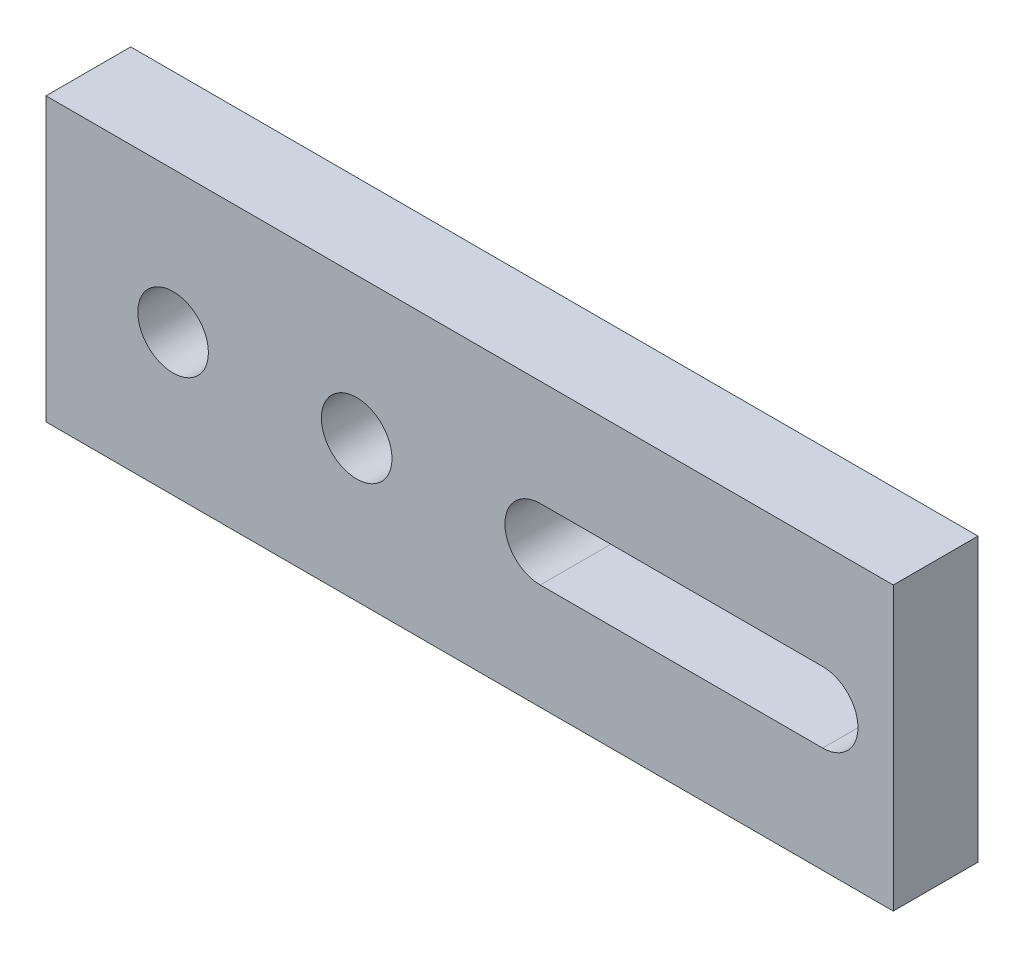
ISO-10303-21;
HEADER;
FILE_DESCRIPTION(('STEP AP214'),'2;1');
FILE_NAME('part.step','',(''),(''),'','','');
FILE_SCHEMA(('AUTOMOTIVE_DESIGN { 1 0 10303 214 1 1 1 1 }'));
ENDSEC;
DATA;
#1=APPLICATION_CONTEXT('core data for automotive mechanical design processes');
#2=APPLICATION_PROTOCOL_DEFINITION('international standard','automotive_design',2000,#1);
#3=PRODUCT_CONTEXT('',#1,'mechanical');
#4=PRODUCT('Part','Part','',(#3));
#5=PRODUCT_RELATED_PRODUCT_CATEGORY('part','',(#4));
#6=PRODUCT_DEFINITION_FORMATION('','',#4);
#7=PRODUCT_DEFINITION_CONTEXT('part definition',#1,'design');
#8=PRODUCT_DEFINITION('design','',#6,#7);
#9=PRODUCT_DEFINITION_SHAPE('','',#8);
#10=(LENGTH_UNIT() NAMED_UNIT(*) SI_UNIT(.MILLI.,.METRE.));
#11=(NAMED_UNIT(*) PLANE_ANGLE_UNIT() SI_UNIT($,.RADIAN.));
#12=(NAMED_UNIT(*) SI_UNIT($,.STERADIAN.) SOLID_ANGLE_UNIT());
#13=UNCERTAINTY_MEASURE_WITH_UNIT(LENGTH_MEASURE(1.E-05),#10,'distance_accuracy_value','');
#14=(GEOMETRIC_REPRESENTATION_CONTEXT(3) GLOBAL_UNCERTAINTY_ASSIGNED_CONTEXT((#13)) GLOBAL_UNIT_ASSIGNED_CONTEXT((#10,
#11,#12)) REPRESENTATION_CONTEXT('',''));
#15=CARTESIAN_POINT('',(0.,0.,0.));
#16=DIRECTION('',(0.,0.,1.));
#17=DIRECTION('',(1.,0.,0.));
#18=AXIS2_PLACEMENT_3D('',#15,#16,#17);
#19=CARTESIAN_POINT('',(0.,0.,6.));
#20=DIRECTION('',(0.,0.,-1.));
#21=DIRECTION('',(-1.,0.,0.));
#22=AXIS2_PLACEMENT_3D('',#19,#20,#21);
#23=PLANE('',#22);
#24=DIRECTION('',(0.,-1.,0.));
#25=VECTOR('',#24,1.);
#26=CARTESIAN_POINT('',(0.,0.,6.));
#27=LINE('',#26,#25);
#28=CARTESIAN_POINT('',(0.,20.,6.));
#29=VERTEX_POINT('',#28);
#30=CARTESIAN_POINT('',(0.,0.,6.));
#31=VERTEX_POINT('',#30);
#32=EDGE_CURVE('E156',#29,#31,#27,.T.);
#33=ORIENTED_EDGE('',*,*,#32,.T.);
#34=DIRECTION('',(1.,0.,0.));
#35=VECTOR('',#34,1.);
#36=CARTESIAN_POINT('',(0.,0.,6.));
#37=LINE('',#36,#35);
#38=CARTESIAN_POINT('',(60.,0.,6.));
#39=VERTEX_POINT('',#38);
#40=EDGE_CURVE('E160',#31,#39,#37,.T.);
#41=ORIENTED_EDGE('',*,*,#40,.T.);
#42=DIRECTION('',(0.,1.,0.));
#43=VECTOR('',#42,1.);
#44=CARTESIAN_POINT('',(60.,0.,6.));
#45=LINE('',#44,#43);
#46=CARTESIAN_POINT('',(60.,20.,6.));
#47=VERTEX_POINT('',#46);
#48=EDGE_CURVE('E164',#39,#47,#45,.T.);
#49=ORIENTED_EDGE('',*,*,#48,.T.);
#50=DIRECTION('',(-1.,0.,0.));
#51=VECTOR('',#50,1.);
#52=CARTESIAN_POINT('',(0.,20.,6.));
#53=LINE('',#52,#51);
#54=EDGE_CURVE('E167',#47,#29,#53,.T.);
#55=ORIENTED_EDGE('',*,*,#54,.T.);
#56=EDGE_LOOP('',(#33,#41,#49,#55));
#57=FACE_BOUND('',#56,.T.);
#58=CARTESIAN_POINT('',(35.,10.,6.));
#59=DIRECTION('',(0.,0.,1.));
#60=DIRECTION('',(1.,0.,0.));
#61=AXIS2_PLACEMENT_3D('',#58,#59,#60);
#62=CIRCLE('',#61,2.5);
#63=CARTESIAN_POINT('',(35.,12.5,6.));
#64=VERTEX_POINT('',#63);
#65=CARTESIAN_POINT('',(35.,7.5,6.));
#66=VERTEX_POINT('',#65);
#67=EDGE_CURVE('E105',#64,#66,#62,.T.);
#68=ORIENTED_EDGE('',*,*,#67,.F.);
#69=DIRECTION('',(-1.,0.,0.));
#70=VECTOR('',#69,1.);
#71=CARTESIAN_POINT('',(35.,12.5,6.));
#72=LINE('',#71,#70);
#73=CARTESIAN_POINT('',(55.,12.5,6.));
#74=VERTEX_POINT('',#73);
#75=EDGE_CURVE('E132',#74,#64,#72,.T.);
#76=ORIENTED_EDGE('',*,*,#75,.F.);
#77=CARTESIAN_POINT('',(55.,10.,6.));
#78=DIRECTION('',(0.,0.,1.));
#79=DIRECTION('',(1.,0.,0.));
#80=AXIS2_PLACEMENT_3D('',#77,#78,#79);
#81=CIRCLE('',#80,2.5);
#82=CARTESIAN_POINT('',(55.,7.5,6.));
#83=VERTEX_POINT('',#82);
#84=EDGE_CURVE('E128',#83,#74,#81,.T.);
#85=ORIENTED_EDGE('',*,*,#84,.F.);
#86=DIRECTION('',(1.,0.,0.));
#87=VECTOR('',#86,1.);
#88=CARTESIAN_POINT('',(35.,7.5,6.));
#89=LINE('',#88,#87);
#90=EDGE_CURVE('E114',#66,#83,#89,.T.);
#91=ORIENTED_EDGE('',*,*,#90,.F.);
#92=EDGE_LOOP('',(#68,#76,#85,#91));
#93=FACE_BOUND('',#92,.T.);
#94=CARTESIAN_POINT('',(22.,10.,6.));
#95=DIRECTION('',(0.,0.,1.));
#96=DIRECTION('',(1.,0.,0.));
#97=AXIS2_PLACEMENT_3D('',#94,#95,#96);
#98=CIRCLE('',#97,2.5);
#99=CARTESIAN_POINT('',(24.5,10.,6.));
#100=VERTEX_POINT('',#99);
#101=EDGE_CURVE('E140',#100,#100,#98,.T.);
#102=ORIENTED_EDGE('',*,*,#101,.F.);
#103=EDGE_LOOP('',(#102));
#104=FACE_BOUND('',#103,.T.);
#105=CARTESIAN_POINT('',(9.,10.,6.));
#106=DIRECTION('',(0.,0.,1.));
#107=DIRECTION('',(1.,0.,0.));
#108=AXIS2_PLACEMENT_3D('',#105,#106,#107);
#109=CIRCLE('',#108,2.5);
#110=CARTESIAN_POINT('',(11.5,10.,6.));
#111=VERTEX_POINT('',#110);
#112=EDGE_CURVE('E256',#111,#111,#109,.T.);
#113=ORIENTED_EDGE('',*,*,#112,.F.);
#114=EDGE_LOOP('',(#113));
#115=FACE_BOUND('',#114,.T.);
#116=ADVANCED_FACE('F39',(#57,#93,#104,#115),#23,.F.);
#117=CARTESIAN_POINT('',(0.,0.,0.));
#118=DIRECTION('',(0.,0.,-1.));
#119=DIRECTION('',(-1.,0.,0.));
#120=AXIS2_PLACEMENT_3D('',#117,#118,#119);
#121=PLANE('',#120);
#122=CARTESIAN_POINT('',(22.,10.,0.));
#123=DIRECTION('',(0.,0.,1.));
#124=DIRECTION('',(1.,0.,0.));
#125=AXIS2_PLACEMENT_3D('',#122,#123,#124);
#126=CIRCLE('',#125,2.5);
#127=CARTESIAN_POINT('',(24.5,10.,0.));
#128=VERTEX_POINT('',#127);
#129=EDGE_CURVE('E264',#128,#128,#126,.T.);
#130=ORIENTED_EDGE('',*,*,#129,.T.);
#131=EDGE_LOOP('',(#130));
#132=FACE_BOUND('',#131,.T.);
#133=DIRECTION('',(0.,-1.,0.));
#134=VECTOR('',#133,1.);
#135=CARTESIAN_POINT('',(0.,0.,0.));
#136=LINE('',#135,#134);
#137=CARTESIAN_POINT('',(0.,20.,0.));
#138=VERTEX_POINT('',#137);
#139=CARTESIAN_POINT('',(0.,0.,0.));
#140=VERTEX_POINT('',#139);
#141=EDGE_CURVE('E123',#138,#140,#136,.T.);
#142=ORIENTED_EDGE('',*,*,#141,.F.);
#143=DIRECTION('',(-1.,0.,0.));
#144=VECTOR('',#143,1.);
#145=CARTESIAN_POINT('',(0.,20.,0.));
#146=LINE('',#145,#144);
#147=CARTESIAN_POINT('',(60.,20.,0.));
#148=VERTEX_POINT('',#147);
#149=EDGE_CURVE('E161',#148,#138,#146,.T.);
#150=ORIENTED_EDGE('',*,*,#149,.F.);
#151=DIRECTION('',(0.,1.,0.));
#152=VECTOR('',#151,1.);
#153=CARTESIAN_POINT('',(60.,0.,0.));
#154=LINE('',#153,#152);
#155=CARTESIAN_POINT('',(60.,0.,0.));
#156=VERTEX_POINT('',#155);
#157=EDGE_CURVE('E177',#156,#148,#154,.T.);
#158=ORIENTED_EDGE('',*,*,#157,.F.);
#159=DIRECTION('',(1.,0.,0.));
#160=VECTOR('',#159,1.);
#161=CARTESIAN_POINT('',(0.,0.,0.));
#162=LINE('',#161,#160);
#163=EDGE_CURVE('E174',#140,#156,#162,.T.);
#164=ORIENTED_EDGE('',*,*,#163,.F.);
#165=EDGE_LOOP('',(#142,#150,#158,#164));
#166=FACE_BOUND('',#165,.T.);
#167=DIRECTION('',(-1.,0.,0.));
#168=VECTOR('',#167,1.);
#169=CARTESIAN_POINT('',(35.,12.5,0.));
#170=LINE('',#169,#168);
#171=CARTESIAN_POINT('',(55.,12.5,0.));
#172=VERTEX_POINT('',#171);
#173=CARTESIAN_POINT('',(35.,12.5,0.));
#174=VERTEX_POINT('',#173);
#175=EDGE_CURVE('E115',#172,#174,#170,.T.);
#176=ORIENTED_EDGE('',*,*,#175,.T.);
#177=CARTESIAN_POINT('',(35.,10.,0.));
#178=DIRECTION('',(0.,0.,1.));
#179=DIRECTION('',(1.,0.,0.));
#180=AXIS2_PLACEMENT_3D('',#177,#178,#179);
#181=CIRCLE('',#180,2.5);
#182=CARTESIAN_POINT('',(35.,7.5,0.));
#183=VERTEX_POINT('',#182);
#184=EDGE_CURVE('E63',#174,#183,#181,.T.);
#185=ORIENTED_EDGE('',*,*,#184,.T.);
#186=DIRECTION('',(1.,0.,0.));
#187=VECTOR('',#186,1.);
#188=CARTESIAN_POINT('',(35.,7.5,0.));
#189=LINE('',#188,#187);
#190=CARTESIAN_POINT('',(55.,7.5,0.));
#191=VERTEX_POINT('',#190);
#192=EDGE_CURVE('E121',#183,#191,#189,.T.);
#193=ORIENTED_EDGE('',*,*,#192,.T.);
#194=CARTESIAN_POINT('',(55.,10.,0.));
#195=DIRECTION('',(0.,0.,1.));
#196=DIRECTION('',(1.,0.,0.));
#197=AXIS2_PLACEMENT_3D('',#194,#195,#196);
#198=CIRCLE('',#197,2.5);
#199=EDGE_CURVE('E143',#191,#172,#198,.T.);
#200=ORIENTED_EDGE('',*,*,#199,.T.);
#201=EDGE_LOOP('',(#176,#185,#193,#200));
#202=FACE_BOUND('',#201,.T.);
#203=CARTESIAN_POINT('',(9.,10.,0.));
#204=DIRECTION('',(0.,0.,1.));
#205=DIRECTION('',(1.,0.,0.));
#206=AXIS2_PLACEMENT_3D('',#203,#204,#205);
#207=CIRCLE('',#206,2.5);
#208=CARTESIAN_POINT('',(11.5,10.,0.));
#209=VERTEX_POINT('',#208);
#210=EDGE_CURVE('E259',#209,#209,#207,.T.);
#211=ORIENTED_EDGE('',*,*,#210,.T.);
#212=EDGE_LOOP('',(#211));
#213=FACE_BOUND('',#212,.T.);
#214=ADVANCED_FACE('F200',(#132,#166,#202,#213),#121,.T.);
#215=CARTESIAN_POINT('',(0.,0.,6.));
#216=DIRECTION('',(1.,0.,0.));
#217=DIRECTION('',(0.,0.,-1.));
#218=AXIS2_PLACEMENT_3D('',#215,#216,#217);
#219=PLANE('',#218);
#220=ORIENTED_EDGE('',*,*,#141,.T.);
#221=DIRECTION('',(0.,0.,-1.));
#222=VECTOR('',#221,1.);
#223=CARTESIAN_POINT('',(0.,0.,6.));
#224=LINE('',#223,#222);
#225=EDGE_CURVE('E11',#31,#140,#224,.T.);
#226=ORIENTED_EDGE('',*,*,#225,.F.);
#227=ORIENTED_EDGE('',*,*,#32,.F.);
#228=DIRECTION('',(0.,0.,-1.));
#229=VECTOR('',#228,1.);
#230=CARTESIAN_POINT('',(0.,20.,6.));
#231=LINE('',#230,#229);
#232=EDGE_CURVE('E170',#29,#138,#231,.T.);
#233=ORIENTED_EDGE('',*,*,#232,.T.);
#234=EDGE_LOOP('',(#220,#226,#227,#233));
#235=FACE_BOUND('',#234,.T.);
#236=ADVANCED_FACE('F41',(#235),#219,.F.);
#237=CARTESIAN_POINT('',(0.,0.,6.));
#238=DIRECTION('',(0.,1.,0.));
#239=DIRECTION('',(0.,0.,1.));
#240=AXIS2_PLACEMENT_3D('',#237,#238,#239);
#241=PLANE('',#240);
#242=ORIENTED_EDGE('',*,*,#163,.T.);
#243=DIRECTION('',(0.,0.,-1.));
#244=VECTOR('',#243,1.);
#245=CARTESIAN_POINT('',(60.,0.,6.));
#246=LINE('',#245,#244);
#247=EDGE_CURVE('E48',#39,#156,#246,.T.);
#248=ORIENTED_EDGE('',*,*,#247,.F.);
#249=ORIENTED_EDGE('',*,*,#40,.F.);
#250=ORIENTED_EDGE('',*,*,#225,.T.);
#251=EDGE_LOOP('',(#242,#248,#249,#250));
#252=FACE_BOUND('',#251,.T.);
#253=ADVANCED_FACE('F210',(#252),#241,.F.);
#254=CARTESIAN_POINT('',(60.,0.,6.));
#255=DIRECTION('',(-1.,0.,0.));
#256=DIRECTION('',(0.,0.,1.));
#257=AXIS2_PLACEMENT_3D('',#254,#255,#256);
#258=PLANE('',#257);
#259=ORIENTED_EDGE('',*,*,#157,.T.);
#260=DIRECTION('',(0.,0.,-1.));
#261=VECTOR('',#260,1.);
#262=CARTESIAN_POINT('',(60.,20.,6.));
#263=LINE('',#262,#261);
#264=EDGE_CURVE('E185',#47,#148,#263,.T.);
#265=ORIENTED_EDGE('',*,*,#264,.F.);
#266=ORIENTED_EDGE('',*,*,#48,.F.);
#267=ORIENTED_EDGE('',*,*,#247,.T.);
#268=EDGE_LOOP('',(#259,#265,#266,#267));
#269=FACE_BOUND('',#268,.T.);
#270=ADVANCED_FACE('F194',(#269),#258,.F.);
#271=CARTESIAN_POINT('',(0.,20.,6.));
#272=DIRECTION('',(0.,-1.,0.));
#273=DIRECTION('',(0.,0.,-1.));
#274=AXIS2_PLACEMENT_3D('',#271,#272,#273);
#275=PLANE('',#274);
#276=ORIENTED_EDGE('',*,*,#149,.T.);
#277=ORIENTED_EDGE('',*,*,#232,.F.);
#278=ORIENTED_EDGE('',*,*,#54,.F.);
#279=ORIENTED_EDGE('',*,*,#264,.T.);
#280=EDGE_LOOP('',(#276,#277,#278,#279));
#281=FACE_BOUND('',#280,.T.);
#282=ADVANCED_FACE('F204',(#281),#275,.F.);
#283=CARTESIAN_POINT('',(35.,10.,6.));
#284=DIRECTION('',(0.,0.,-1.));
#285=DIRECTION('',(-1.,0.,0.));
#286=AXIS2_PLACEMENT_3D('',#283,#284,#285);
#287=CYLINDRICAL_SURFACE('',#286,2.5);
#288=ORIENTED_EDGE('',*,*,#184,.F.);
#289=DIRECTION('',(0.,0.,-1.));
#290=VECTOR('',#289,1.);
#291=CARTESIAN_POINT('',(35.,12.5,6.));
#292=LINE('',#291,#290);
#293=EDGE_CURVE('E109',#64,#174,#292,.T.);
#294=ORIENTED_EDGE('',*,*,#293,.F.);
#295=ORIENTED_EDGE('',*,*,#67,.T.);
#296=DIRECTION('',(0.,0.,-1.));
#297=VECTOR('',#296,1.);
#298=CARTESIAN_POINT('',(35.,7.5,6.));
#299=LINE('',#298,#297);
#300=EDGE_CURVE('E108',#66,#183,#299,.T.);
#301=ORIENTED_EDGE('',*,*,#300,.T.);
#302=EDGE_LOOP('',(#288,#294,#295,#301));
#303=FACE_BOUND('',#302,.T.);
#304=ADVANCED_FACE('F107',(#303),#287,.F.);
#305=CARTESIAN_POINT('',(35.,7.5,6.));
#306=DIRECTION('',(0.,1.,0.));
#307=DIRECTION('',(0.,0.,1.));
#308=AXIS2_PLACEMENT_3D('',#305,#306,#307);
#309=PLANE('',#308);
#310=ORIENTED_EDGE('',*,*,#192,.F.);
#311=ORIENTED_EDGE('',*,*,#300,.F.);
#312=ORIENTED_EDGE('',*,*,#90,.T.);
#313=DIRECTION('',(0.,0.,-1.));
#314=VECTOR('',#313,1.);
#315=CARTESIAN_POINT('',(55.,7.5,6.));
#316=LINE('',#315,#314);
#317=EDGE_CURVE('E124',#83,#191,#316,.T.);
#318=ORIENTED_EDGE('',*,*,#317,.T.);
#319=EDGE_LOOP('',(#310,#311,#312,#318));
#320=FACE_BOUND('',#319,.T.);
#321=ADVANCED_FACE('F118',(#320),#309,.T.);
#322=CARTESIAN_POINT('',(55.,10.,6.));
#323=DIRECTION('',(0.,0.,-1.));
#324=DIRECTION('',(-1.,0.,0.));
#325=AXIS2_PLACEMENT_3D('',#322,#323,#324);
#326=CYLINDRICAL_SURFACE('',#325,2.5);
#327=ORIENTED_EDGE('',*,*,#199,.F.);
#328=ORIENTED_EDGE('',*,*,#317,.F.);
#329=ORIENTED_EDGE('',*,*,#84,.T.);
#330=DIRECTION('',(0.,0.,-1.));
#331=VECTOR('',#330,1.);
#332=CARTESIAN_POINT('',(55.,12.5,6.));
#333=LINE('',#332,#331);
#334=EDGE_CURVE('E55',#74,#172,#333,.T.);
#335=ORIENTED_EDGE('',*,*,#334,.T.);
#336=EDGE_LOOP('',(#327,#328,#329,#335));
#337=FACE_BOUND('',#336,.T.);
#338=ADVANCED_FACE('F234',(#337),#326,.F.);
#339=CARTESIAN_POINT('',(35.,12.5,6.));
#340=DIRECTION('',(0.,-1.,0.));
#341=DIRECTION('',(0.,0.,-1.));
#342=AXIS2_PLACEMENT_3D('',#339,#340,#341);
#343=PLANE('',#342);
#344=ORIENTED_EDGE('',*,*,#175,.F.);
#345=ORIENTED_EDGE('',*,*,#334,.F.);
#346=ORIENTED_EDGE('',*,*,#75,.T.);
#347=ORIENTED_EDGE('',*,*,#293,.T.);
#348=EDGE_LOOP('',(#344,#345,#346,#347));
#349=FACE_BOUND('',#348,.T.);
#350=ADVANCED_FACE('F238',(#349),#343,.T.);
#351=CARTESIAN_POINT('',(22.,10.,6.));
#352=DIRECTION('',(0.,0.,-1.));
#353=DIRECTION('',(-1.,0.,0.));
#354=AXIS2_PLACEMENT_3D('',#351,#352,#353);
#355=CYLINDRICAL_SURFACE('',#354,2.5);
#356=ORIENTED_EDGE('',*,*,#101,.T.);
#357=EDGE_LOOP('',(#356));
#358=FACE_BOUND('',#357,.T.);
#359=ORIENTED_EDGE('',*,*,#129,.F.);
#360=EDGE_LOOP('',(#359));
#361=FACE_BOUND('',#360,.T.);
#362=ADVANCED_FACE('F244',(#358,#361),#355,.F.);
#363=CARTESIAN_POINT('',(9.,10.,6.));
#364=DIRECTION('',(0.,0.,-1.));
#365=DIRECTION('',(-1.,0.,0.));
#366=AXIS2_PLACEMENT_3D('',#363,#364,#365);
#367=CYLINDRICAL_SURFACE('',#366,2.5);
#368=ORIENTED_EDGE('',*,*,#112,.T.);
#369=EDGE_LOOP('',(#368));
#370=FACE_BOUND('',#369,.T.);
#371=ORIENTED_EDGE('',*,*,#210,.F.);
#372=EDGE_LOOP('',(#371));
#373=FACE_BOUND('',#372,.T.);
#374=ADVANCED_FACE('F247',(#370,#373),#367,.F.);
#375=CLOSED_SHELL('',(#116,#214,#236,#253,#270,#282,#304,#321,#338,#350,#362,#374));
#376=MANIFOLD_SOLID_BREP('B2',#375);
#377=ADVANCED_BREP_SHAPE_REPRESENTATION('',(#18,#376),#14);
#378=SHAPE_DEFINITION_REPRESENTATION(#9,#377);
ENDSEC;
END-ISO-10303-21;
